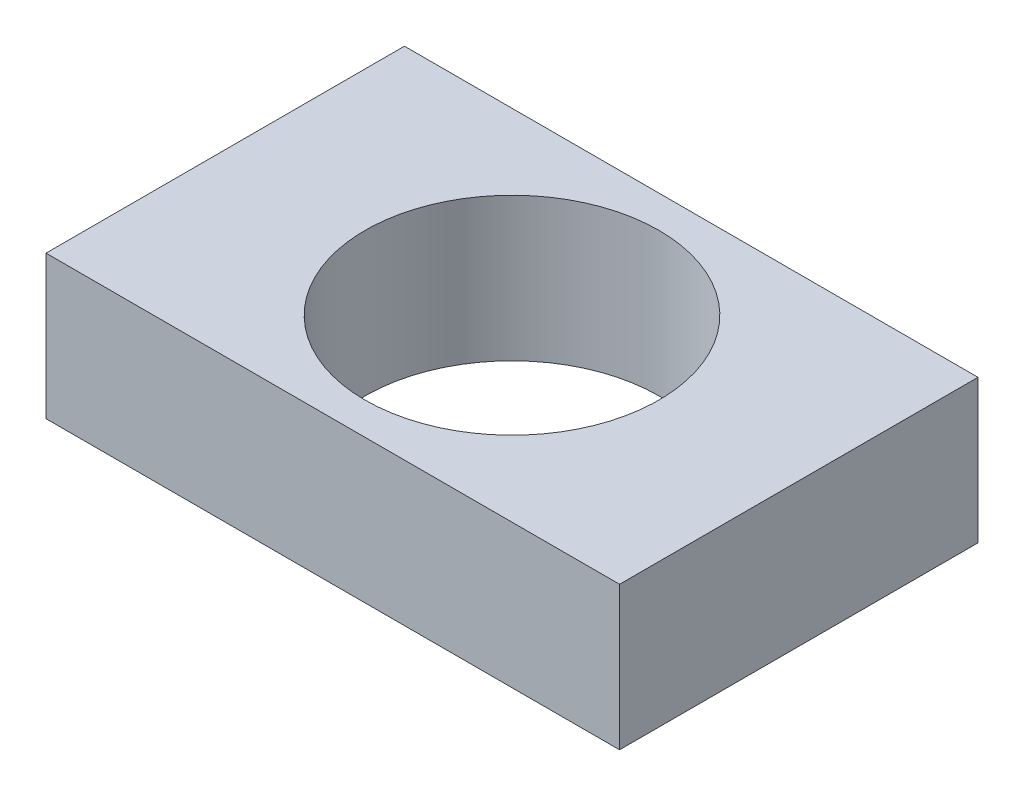
ISO-10303-21;
HEADER;
FILE_DESCRIPTION(('STEP AP214'),'2;1');
FILE_NAME('part.step','',(''),(''),'','','');
FILE_SCHEMA(('AUTOMOTIVE_DESIGN { 1 0 10303 214 1 1 1 1 }'));
ENDSEC;
DATA;
#1=APPLICATION_CONTEXT('core data for automotive mechanical design processes');
#2=APPLICATION_PROTOCOL_DEFINITION('international standard','automotive_design',2000,#1);
#3=PRODUCT_CONTEXT('',#1,'mechanical');
#4=PRODUCT('Part','Part','',(#3));
#5=PRODUCT_RELATED_PRODUCT_CATEGORY('part','',(#4));
#6=PRODUCT_DEFINITION_FORMATION('','',#4);
#7=PRODUCT_DEFINITION_CONTEXT('part definition',#1,'design');
#8=PRODUCT_DEFINITION('design','',#6,#7);
#9=PRODUCT_DEFINITION_SHAPE('','',#8);
#10=(LENGTH_UNIT() NAMED_UNIT(*) SI_UNIT(.MILLI.,.METRE.));
#11=(NAMED_UNIT(*) PLANE_ANGLE_UNIT() SI_UNIT($,.RADIAN.));
#12=(NAMED_UNIT(*) SI_UNIT($,.STERADIAN.) SOLID_ANGLE_UNIT());
#13=UNCERTAINTY_MEASURE_WITH_UNIT(LENGTH_MEASURE(1.E-05),#10,'distance_accuracy_value','');
#14=(GEOMETRIC_REPRESENTATION_CONTEXT(3) GLOBAL_UNCERTAINTY_ASSIGNED_CONTEXT((#13)) GLOBAL_UNIT_ASSIGNED_CONTEXT((#10,
#11,#12)) REPRESENTATION_CONTEXT('',''));
#15=CARTESIAN_POINT('',(0.,0.,0.));
#16=DIRECTION('',(0.,0.,1.));
#17=DIRECTION('',(1.,0.,0.));
#18=AXIS2_PLACEMENT_3D('',#15,#16,#17);
#19=CARTESIAN_POINT('',(-72.8321297725147,2515.40771216203,7.20789184703859));
#20=DIRECTION('',(1.,0.,0.));
#21=DIRECTION('',(0.,0.,-1.));
#22=AXIS2_PLACEMENT_3D('',#19,#20,#21);
#23=PLANE('',#22);
#24=DIRECTION('',(0.,0.,1.));
#25=VECTOR('',#24,1.);
#26=CARTESIAN_POINT('',(-72.8321297725147,2495.40771216203,7.20789184703859));
#27=LINE('',#26,#25);
#28=CARTESIAN_POINT('',(-72.8321297725147,2495.40771216203,-42.7921081529614));
#29=VERTEX_POINT('',#28);
#30=CARTESIAN_POINT('',(-72.8321297725147,2495.40771216203,7.20789184703859));
#31=VERTEX_POINT('',#30);
#32=EDGE_CURVE('E96',#29,#31,#27,.T.);
#33=ORIENTED_EDGE('',*,*,#32,.T.);
#34=DIRECTION('',(0.,-1.,0.));
#35=VECTOR('',#34,1.);
#36=CARTESIAN_POINT('',(-72.8321297725147,2515.40771216203,7.20789184703859));
#37=LINE('',#36,#35);
#38=CARTESIAN_POINT('',(-72.8321297725147,2515.40771216203,7.20789184703859));
#39=VERTEX_POINT('',#38);
#40=EDGE_CURVE('E11',#39,#31,#37,.T.);
#41=ORIENTED_EDGE('',*,*,#40,.F.);
#42=DIRECTION('',(0.,0.,1.));
#43=VECTOR('',#42,1.);
#44=CARTESIAN_POINT('',(-72.8321297725147,2515.40771216203,7.20789184703859));
#45=LINE('',#44,#43);
#46=CARTESIAN_POINT('',(-72.8321297725147,2515.40771216203,-42.7921081529614));
#47=VERTEX_POINT('',#46);
#48=EDGE_CURVE('E84',#47,#39,#45,.T.);
#49=ORIENTED_EDGE('',*,*,#48,.F.);
#50=DIRECTION('',(0.,-1.,0.));
#51=VECTOR('',#50,1.);
#52=CARTESIAN_POINT('',(-72.8321297725147,2515.40771216203,-42.7921081529614));
#53=LINE('',#52,#51);
#54=EDGE_CURVE('E92',#47,#29,#53,.T.);
#55=ORIENTED_EDGE('',*,*,#54,.T.);
#56=EDGE_LOOP('',(#33,#41,#49,#55));
#57=FACE_BOUND('',#56,.T.);
#58=ADVANCED_FACE('F33',(#57),#23,.F.);
#59=CARTESIAN_POINT('',(7.16787022748527,2515.40771216203,7.20789184703858));
#60=DIRECTION('',(0.,0.,-1.));
#61=DIRECTION('',(-1.,0.,0.));
#62=AXIS2_PLACEMENT_3D('',#59,#60,#61);
#63=PLANE('',#62);
#64=DIRECTION('',(1.,0.,0.));
#65=VECTOR('',#64,1.);
#66=CARTESIAN_POINT('',(7.16787022748527,2495.40771216203,7.20789184703858));
#67=LINE('',#66,#65);
#68=CARTESIAN_POINT('',(7.16787022748527,2495.40771216203,7.20789184703858));
#69=VERTEX_POINT('',#68);
#70=EDGE_CURVE('E88',#31,#69,#67,.T.);
#71=ORIENTED_EDGE('',*,*,#70,.T.);
#72=DIRECTION('',(0.,-1.,0.));
#73=VECTOR('',#72,1.);
#74=CARTESIAN_POINT('',(7.16787022748527,2515.40771216203,7.20789184703858));
#75=LINE('',#74,#73);
#76=CARTESIAN_POINT('',(7.16787022748527,2515.40771216203,7.20789184703858));
#77=VERTEX_POINT('',#76);
#78=EDGE_CURVE('E41',#77,#69,#75,.T.);
#79=ORIENTED_EDGE('',*,*,#78,.F.);
#80=DIRECTION('',(1.,0.,0.));
#81=VECTOR('',#80,1.);
#82=CARTESIAN_POINT('',(7.16787022748527,2515.40771216203,7.20789184703858));
#83=LINE('',#82,#81);
#84=EDGE_CURVE('E79',#39,#77,#83,.T.);
#85=ORIENTED_EDGE('',*,*,#84,.F.);
#86=ORIENTED_EDGE('',*,*,#40,.T.);
#87=EDGE_LOOP('',(#71,#79,#85,#86));
#88=FACE_BOUND('',#87,.T.);
#89=ADVANCED_FACE('F87',(#88),#63,.F.);
#90=CARTESIAN_POINT('',(7.16787022748527,2515.40771216203,7.20789184703858));
#91=DIRECTION('',(-1.,0.,0.));
#92=DIRECTION('',(0.,0.,1.));
#93=AXIS2_PLACEMENT_3D('',#90,#91,#92);
#94=PLANE('',#93);
#95=DIRECTION('',(0.,0.,-1.));
#96=VECTOR('',#95,1.);
#97=CARTESIAN_POINT('',(7.16787022748527,2495.40771216203,7.20789184703858));
#98=LINE('',#97,#96);
#99=CARTESIAN_POINT('',(7.16787022748527,2495.40771216203,-42.7921081529614));
#100=VERTEX_POINT('',#99);
#101=EDGE_CURVE('E66',#69,#100,#98,.T.);
#102=ORIENTED_EDGE('',*,*,#101,.T.);
#103=DIRECTION('',(0.,-1.,0.));
#104=VECTOR('',#103,1.);
#105=CARTESIAN_POINT('',(7.16787022748527,2515.40771216203,-42.7921081529614));
#106=LINE('',#105,#104);
#107=CARTESIAN_POINT('',(7.16787022748527,2515.40771216203,-42.7921081529614));
#108=VERTEX_POINT('',#107);
#109=EDGE_CURVE('E89',#108,#100,#106,.T.);
#110=ORIENTED_EDGE('',*,*,#109,.F.);
#111=DIRECTION('',(0.,0.,-1.));
#112=VECTOR('',#111,1.);
#113=CARTESIAN_POINT('',(7.16787022748527,2515.40771216203,7.20789184703858));
#114=LINE('',#113,#112);
#115=EDGE_CURVE('E82',#77,#108,#114,.T.);
#116=ORIENTED_EDGE('',*,*,#115,.F.);
#117=ORIENTED_EDGE('',*,*,#78,.T.);
#118=EDGE_LOOP('',(#102,#110,#116,#117));
#119=FACE_BOUND('',#118,.T.);
#120=ADVANCED_FACE('F90',(#119),#94,.F.);
#121=CARTESIAN_POINT('',(7.16787022748527,2515.40771216203,-42.7921081529614));
#122=DIRECTION('',(0.,0.,1.));
#123=DIRECTION('',(1.,0.,0.));
#124=AXIS2_PLACEMENT_3D('',#121,#122,#123);
#125=PLANE('',#124);
#126=DIRECTION('',(-1.,0.,0.));
#127=VECTOR('',#126,1.);
#128=CARTESIAN_POINT('',(7.16787022748527,2495.40771216203,-42.7921081529614));
#129=LINE('',#128,#127);
#130=EDGE_CURVE('E72',#100,#29,#129,.T.);
#131=ORIENTED_EDGE('',*,*,#130,.T.);
#132=ORIENTED_EDGE('',*,*,#54,.F.);
#133=DIRECTION('',(-1.,0.,0.));
#134=VECTOR('',#133,1.);
#135=CARTESIAN_POINT('',(7.16787022748527,2515.40771216203,-42.7921081529614));
#136=LINE('',#135,#134);
#137=EDGE_CURVE('E49',#108,#47,#136,.T.);
#138=ORIENTED_EDGE('',*,*,#137,.F.);
#139=ORIENTED_EDGE('',*,*,#109,.T.);
#140=EDGE_LOOP('',(#131,#132,#138,#139));
#141=FACE_BOUND('',#140,.T.);
#142=ADVANCED_FACE('F104',(#141),#125,.F.);
#143=CARTESIAN_POINT('',(-72.8321297725147,2515.40771216203,-42.7921081529614));
#144=DIRECTION('',(0.,1.,0.));
#145=DIRECTION('',(0.,0.,1.));
#146=AXIS2_PLACEMENT_3D('',#143,#144,#145);
#147=PLANE('',#146);
#148=CARTESIAN_POINT('',(-32.8321297725147,2515.40771216203,-17.7921081529614));
#149=DIRECTION('',(0.,1.,0.));
#150=DIRECTION('',(0.,0.,1.));
#151=AXIS2_PLACEMENT_3D('',#148,#149,#150);
#152=CIRCLE('',#151,20.5000000000028);
#153=CARTESIAN_POINT('',(-32.8321297725147,2515.40771216203,2.70789184704137));
#154=VERTEX_POINT('',#153);
#155=EDGE_CURVE('E110',#154,#154,#152,.F.);
#156=ORIENTED_EDGE('',*,*,#155,.T.);
#157=EDGE_LOOP('',(#156));
#158=FACE_BOUND('',#157,.T.);
#159=ORIENTED_EDGE('',*,*,#48,.T.);
#160=ORIENTED_EDGE('',*,*,#84,.T.);
#161=ORIENTED_EDGE('',*,*,#115,.T.);
#162=ORIENTED_EDGE('',*,*,#137,.T.);
#163=EDGE_LOOP('',(#159,#160,#161,#162));
#164=FACE_BOUND('',#163,.T.);
#165=ADVANCED_FACE('F80',(#158,#164),#147,.T.);
#166=CARTESIAN_POINT('',(-72.8321297725147,2495.40771216203,-42.7921081529614));
#167=DIRECTION('',(0.,1.,0.));
#168=DIRECTION('',(0.,0.,1.));
#169=AXIS2_PLACEMENT_3D('',#166,#167,#168);
#170=PLANE('',#169);
#171=CARTESIAN_POINT('',(-32.8321297725147,2495.40771216203,-17.7921081529614));
#172=DIRECTION('',(0.,-1.,0.));
#173=DIRECTION('',(0.,0.,-1.));
#174=AXIS2_PLACEMENT_3D('',#171,#172,#173);
#175=CIRCLE('',#174,20.5000000000028);
#176=CARTESIAN_POINT('',(-32.8321297725147,2495.40771216203,-38.2921081529642));
#177=VERTEX_POINT('',#176);
#178=EDGE_CURVE('E99',#177,#177,#175,.T.);
#179=ORIENTED_EDGE('',*,*,#178,.F.);
#180=EDGE_LOOP('',(#179));
#181=FACE_BOUND('',#180,.T.);
#182=ORIENTED_EDGE('',*,*,#32,.F.);
#183=ORIENTED_EDGE('',*,*,#130,.F.);
#184=ORIENTED_EDGE('',*,*,#101,.F.);
#185=ORIENTED_EDGE('',*,*,#70,.F.);
#186=EDGE_LOOP('',(#182,#183,#184,#185));
#187=FACE_BOUND('',#186,.T.);
#188=ADVANCED_FACE('F107',(#181,#187),#170,.F.);
#189=CARTESIAN_POINT('',(-32.8321297725147,2515.40871216203,-17.7921081529614));
#190=DIRECTION('',(0.,-1.,0.));
#191=DIRECTION('',(0.,0.,-1.));
#192=AXIS2_PLACEMENT_3D('',#189,#190,#191);
#193=CYLINDRICAL_SURFACE('',#192,20.5000000000028);
#194=ORIENTED_EDGE('',*,*,#155,.F.);
#195=EDGE_LOOP('',(#194));
#196=FACE_BOUND('',#195,.T.);
#197=ORIENTED_EDGE('',*,*,#178,.T.);
#198=EDGE_LOOP('',(#197));
#199=FACE_BOUND('',#198,.T.);
#200=ADVANCED_FACE('F116',(#196,#199),#193,.F.);
#201=CLOSED_SHELL('',(#58,#89,#120,#142,#165,#188,#200));
#202=MANIFOLD_SOLID_BREP('B2',#201);
#203=ADVANCED_BREP_SHAPE_REPRESENTATION('',(#18,#202),#14);
#204=SHAPE_DEFINITION_REPRESENTATION(#9,#203);
ENDSEC;
END-ISO-10303-21;
